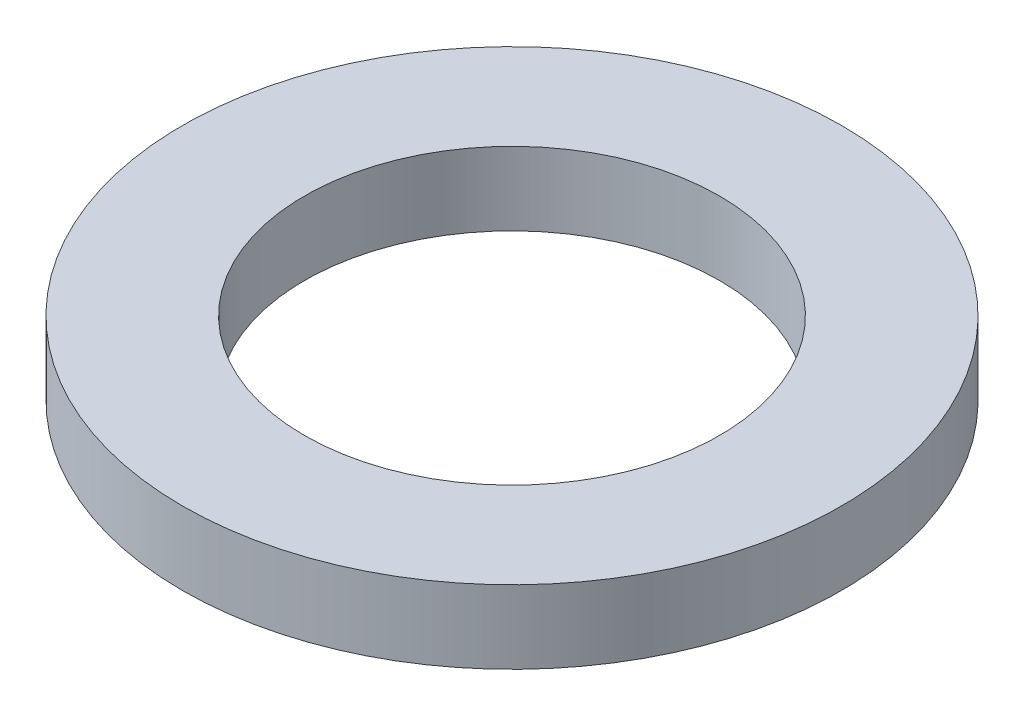
ISO-10303-21;
HEADER;
FILE_DESCRIPTION(('STEP AP214'),'2;1');
FILE_NAME('part.step','',(''),(''),'','','');
FILE_SCHEMA(('AUTOMOTIVE_DESIGN { 1 0 10303 214 1 1 1 1 }'));
ENDSEC;
DATA;
#1=APPLICATION_CONTEXT('core data for automotive mechanical design processes');
#2=APPLICATION_PROTOCOL_DEFINITION('international standard','automotive_design',2000,#1);
#3=PRODUCT_CONTEXT('',#1,'mechanical');
#4=PRODUCT('Part','Part','',(#3));
#5=PRODUCT_RELATED_PRODUCT_CATEGORY('part','',(#4));
#6=PRODUCT_DEFINITION_FORMATION('','',#4);
#7=PRODUCT_DEFINITION_CONTEXT('part definition',#1,'design');
#8=PRODUCT_DEFINITION('design','',#6,#7);
#9=PRODUCT_DEFINITION_SHAPE('','',#8);
#10=(LENGTH_UNIT() NAMED_UNIT(*) SI_UNIT(.MILLI.,.METRE.));
#11=(NAMED_UNIT(*) PLANE_ANGLE_UNIT() SI_UNIT($,.RADIAN.));
#12=(NAMED_UNIT(*) SI_UNIT($,.STERADIAN.) SOLID_ANGLE_UNIT());
#13=UNCERTAINTY_MEASURE_WITH_UNIT(LENGTH_MEASURE(1.E-05),#10,'distance_accuracy_value','');
#14=(GEOMETRIC_REPRESENTATION_CONTEXT(3) GLOBAL_UNCERTAINTY_ASSIGNED_CONTEXT((#13)) GLOBAL_UNIT_ASSIGNED_CONTEXT((#10,
#11,#12)) REPRESENTATION_CONTEXT('',''));
#15=CARTESIAN_POINT('',(0.,0.,0.));
#16=DIRECTION('',(0.,0.,1.));
#17=DIRECTION('',(1.,0.,0.));
#18=AXIS2_PLACEMENT_3D('',#15,#16,#17);
#19=CARTESIAN_POINT('',(0.,3.,0.));
#20=DIRECTION('',(0.,1.,0.));
#21=DIRECTION('',(0.,0.,1.));
#22=AXIS2_PLACEMENT_3D('',#19,#20,#21);
#23=PLANE('',#22);
#24=CARTESIAN_POINT('',(0.,3.,0.));
#25=DIRECTION('',(0.,1.,0.));
#26=DIRECTION('',(0.,0.,1.));
#27=AXIS2_PLACEMENT_3D('',#24,#25,#26);
#28=CIRCLE('',#27,13.5);
#29=CARTESIAN_POINT('',(0.,3.,13.5));
#30=VERTEX_POINT('',#29);
#31=EDGE_CURVE('E10',#30,#30,#28,.T.);
#32=ORIENTED_EDGE('',*,*,#31,.T.);
#33=EDGE_LOOP('',(#32));
#34=FACE_BOUND('',#33,.T.);
#35=CARTESIAN_POINT('',(0.,3.,0.));
#36=DIRECTION('',(0.,1.,0.));
#37=DIRECTION('',(0.,0.,1.));
#38=AXIS2_PLACEMENT_3D('',#35,#36,#37);
#39=CIRCLE('',#38,8.5);
#40=CARTESIAN_POINT('',(0.,3.,8.5));
#41=VERTEX_POINT('',#40);
#42=EDGE_CURVE('E42',#41,#41,#39,.T.);
#43=ORIENTED_EDGE('',*,*,#42,.F.);
#44=EDGE_LOOP('',(#43));
#45=FACE_BOUND('',#44,.T.);
#46=ADVANCED_FACE('F31',(#34,#45),#23,.T.);
#47=CARTESIAN_POINT('',(0.,0.,0.));
#48=DIRECTION('',(0.,1.,0.));
#49=DIRECTION('',(0.,0.,1.));
#50=AXIS2_PLACEMENT_3D('',#47,#48,#49);
#51=PLANE('',#50);
#52=CARTESIAN_POINT('',(0.,0.,0.));
#53=DIRECTION('',(0.,1.,0.));
#54=DIRECTION('',(0.,0.,1.));
#55=AXIS2_PLACEMENT_3D('',#52,#53,#54);
#56=CIRCLE('',#55,13.5);
#57=CARTESIAN_POINT('',(0.,0.,13.5));
#58=VERTEX_POINT('',#57);
#59=EDGE_CURVE('E35',#58,#58,#56,.T.);
#60=ORIENTED_EDGE('',*,*,#59,.F.);
#61=EDGE_LOOP('',(#60));
#62=FACE_BOUND('',#61,.T.);
#63=CARTESIAN_POINT('',(0.,0.,0.));
#64=DIRECTION('',(0.,1.,0.));
#65=DIRECTION('',(0.,0.,1.));
#66=AXIS2_PLACEMENT_3D('',#63,#64,#65);
#67=CIRCLE('',#66,8.5);
#68=CARTESIAN_POINT('',(0.,0.,8.5));
#69=VERTEX_POINT('',#68);
#70=EDGE_CURVE('E44',#69,#69,#67,.T.);
#71=ORIENTED_EDGE('',*,*,#70,.T.);
#72=EDGE_LOOP('',(#71));
#73=FACE_BOUND('',#72,.T.);
#74=ADVANCED_FACE('F54',(#62,#73),#51,.F.);
#75=CARTESIAN_POINT('',(0.,3.,0.));
#76=DIRECTION('',(0.,-1.,0.));
#77=DIRECTION('',(0.,0.,-1.));
#78=AXIS2_PLACEMENT_3D('',#75,#76,#77);
#79=CYLINDRICAL_SURFACE('',#78,13.5);
#80=ORIENTED_EDGE('',*,*,#31,.F.);
#81=EDGE_LOOP('',(#80));
#82=FACE_BOUND('',#81,.T.);
#83=ORIENTED_EDGE('',*,*,#59,.T.);
#84=EDGE_LOOP('',(#83));
#85=FACE_BOUND('',#84,.T.);
#86=ADVANCED_FACE('F33',(#82,#85),#79,.T.);
#87=CARTESIAN_POINT('',(0.,3.,0.));
#88=DIRECTION('',(0.,-1.,0.));
#89=DIRECTION('',(0.,0.,-1.));
#90=AXIS2_PLACEMENT_3D('',#87,#88,#89);
#91=CYLINDRICAL_SURFACE('',#90,8.5);
#92=ORIENTED_EDGE('',*,*,#42,.T.);
#93=EDGE_LOOP('',(#92));
#94=FACE_BOUND('',#93,.T.);
#95=ORIENTED_EDGE('',*,*,#70,.F.);
#96=EDGE_LOOP('',(#95));
#97=FACE_BOUND('',#96,.T.);
#98=ADVANCED_FACE('F50',(#94,#97),#91,.F.);
#99=CLOSED_SHELL('',(#46,#74,#86,#98));
#100=MANIFOLD_SOLID_BREP('B2',#99);
#101=ADVANCED_BREP_SHAPE_REPRESENTATION('',(#18,#100),#14);
#102=SHAPE_DEFINITION_REPRESENTATION(#9,#101);
ENDSEC;
END-ISO-10303-21;
